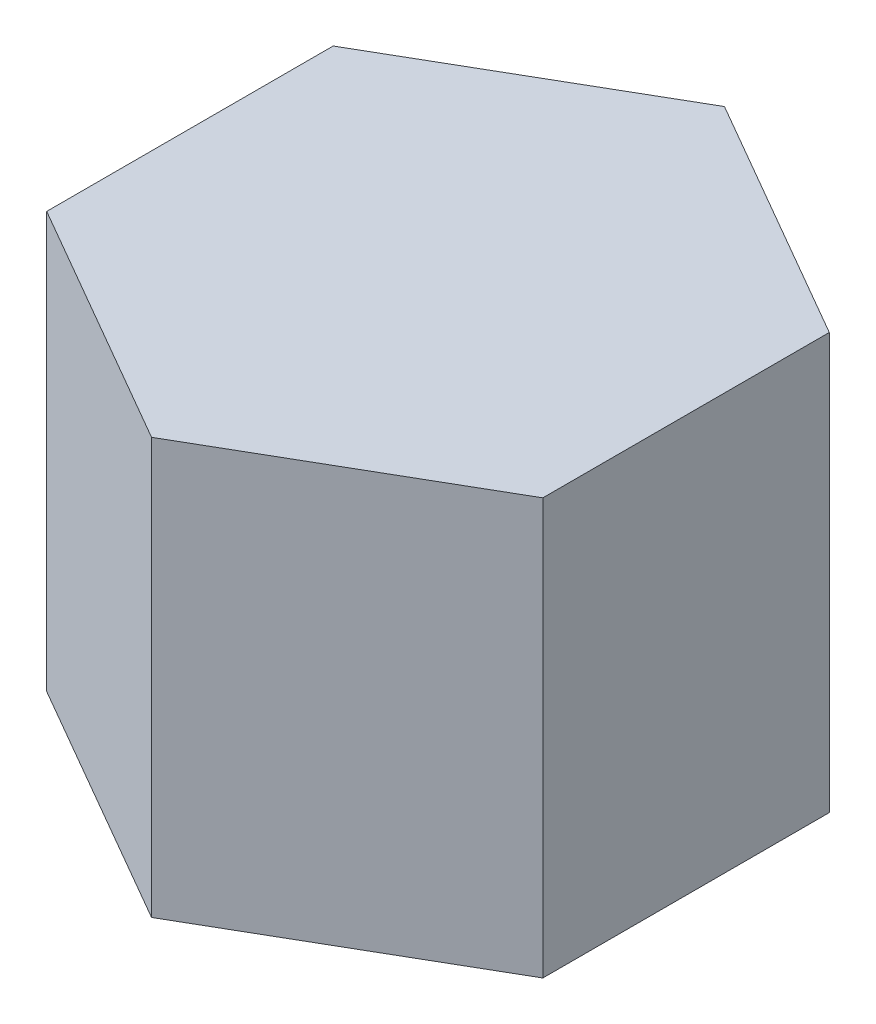
ISO-10303-21;
HEADER;
FILE_DESCRIPTION(('STEP AP214'),'2;1');
FILE_NAME('part.step','',(''),(''),'','','');
FILE_SCHEMA(('AUTOMOTIVE_DESIGN { 1 0 10303 214 1 1 1 1 }'));
ENDSEC;
DATA;
#1=APPLICATION_CONTEXT('core data for automotive mechanical design processes');
#2=APPLICATION_PROTOCOL_DEFINITION('international standard','automotive_design',2000,#1);
#3=PRODUCT_CONTEXT('',#1,'mechanical');
#4=PRODUCT('Part','Part','',(#3));
#5=PRODUCT_RELATED_PRODUCT_CATEGORY('part','',(#4));
#6=PRODUCT_DEFINITION_FORMATION('','',#4);
#7=PRODUCT_DEFINITION_CONTEXT('part definition',#1,'design');
#8=PRODUCT_DEFINITION('design','',#6,#7);
#9=PRODUCT_DEFINITION_SHAPE('','',#8);
#10=(LENGTH_UNIT() NAMED_UNIT(*) SI_UNIT(.MILLI.,.METRE.));
#11=(NAMED_UNIT(*) PLANE_ANGLE_UNIT() SI_UNIT($,.RADIAN.));
#12=(NAMED_UNIT(*) SI_UNIT($,.STERADIAN.) SOLID_ANGLE_UNIT());
#13=UNCERTAINTY_MEASURE_WITH_UNIT(LENGTH_MEASURE(1.E-05),#10,'distance_accuracy_value','');
#14=(GEOMETRIC_REPRESENTATION_CONTEXT(3) GLOBAL_UNCERTAINTY_ASSIGNED_CONTEXT((#13)) GLOBAL_UNIT_ASSIGNED_CONTEXT((#10,
#11,#12)) REPRESENTATION_CONTEXT('',''));
#15=CARTESIAN_POINT('',(0.,0.,0.));
#16=DIRECTION('',(0.,0.,1.));
#17=DIRECTION('',(1.,0.,0.));
#18=AXIS2_PLACEMENT_3D('',#15,#16,#17);
#19=CARTESIAN_POINT('',(209.642660308706,-148.537700895744,288.042869605357));
#20=DIRECTION('',(-0.499999999999943,0.,-0.866025403784472));
#21=DIRECTION('',(-0.866025403784472,0.,0.499999999999943));
#22=AXIS2_PLACEMENT_3D('',#19,#20,#21);
#23=PLANE('',#22);
#24=CARTESIAN_POINT('',(209.339551417382,-149.045793579175,288.217869605357));
#25=DIRECTION('',(0.866025403784471,0.,-0.499999999999943));
#26=VECTOR('',#25,1.);
#27=LINE('',#24,#26);
#28=CARTESIAN_POINT('',(209.339551417382,-149.045793579175,288.217869605357));
#29=VERTEX_POINT('',#28);
#30=CARTESIAN_POINT('',(209.642660308706,-149.045793579175,288.042869605357));
#31=VERTEX_POINT('',#30);
#32=EDGE_CURVE('E170',#29,#31,#27,.T.);
#33=ORIENTED_EDGE('',*,*,#32,.T.);
#34=CARTESIAN_POINT('',(209.642660308706,-148.537700895744,288.042869605357));
#35=DIRECTION('',(0.,-1.,0.));
#36=VECTOR('',#35,1.);
#37=LINE('',#34,#36);
#38=CARTESIAN_POINT('',(209.642660308706,-148.537700895744,288.042869605357));
#39=VERTEX_POINT('',#38);
#40=EDGE_CURVE('E35',#39,#31,#37,.T.);
#41=ORIENTED_EDGE('',*,*,#40,.F.);
#42=CARTESIAN_POINT('',(209.339551417382,-148.537700895744,288.217869605357));
#43=DIRECTION('',(0.866025403784471,0.,-0.499999999999943));
#44=VECTOR('',#43,1.);
#45=LINE('',#42,#44);
#46=CARTESIAN_POINT('',(209.339551417382,-148.537700895744,288.217869605357));
#47=VERTEX_POINT('',#46);
#48=EDGE_CURVE('E159',#47,#39,#45,.T.);
#49=ORIENTED_EDGE('',*,*,#48,.F.);
#50=CARTESIAN_POINT('',(209.339551417382,-148.537700895744,288.217869605357));
#51=DIRECTION('',(0.,-1.,0.));
#52=VECTOR('',#51,1.);
#53=LINE('',#50,#52);
#54=EDGE_CURVE('E10',#47,#29,#53,.T.);
#55=ORIENTED_EDGE('',*,*,#54,.T.);
#56=EDGE_LOOP('',(#33,#41,#49,#55));
#57=FACE_BOUND('',#56,.T.);
#58=ADVANCED_FACE('F16',(#57),#23,.F.);
#59=CARTESIAN_POINT('',(209.339551417382,-148.537700895744,288.217869605357));
#60=DIRECTION('',(0.500000000000062,0.,-0.866025403784403));
#61=DIRECTION('',(-0.866025403784403,0.,-0.500000000000062));
#62=AXIS2_PLACEMENT_3D('',#59,#60,#61);
#63=PLANE('',#62);
#64=CARTESIAN_POINT('',(209.036442526057,-149.045793579175,288.042869605357));
#65=DIRECTION('',(0.866025403784403,0.,0.500000000000062));
#66=VECTOR('',#65,1.);
#67=LINE('',#64,#66);
#68=CARTESIAN_POINT('',(209.036442526057,-149.045793579175,288.042869605357));
#69=VERTEX_POINT('',#68);
#70=EDGE_CURVE('E167',#69,#29,#67,.T.);
#71=ORIENTED_EDGE('',*,*,#70,.T.);
#72=ORIENTED_EDGE('',*,*,#54,.F.);
#73=CARTESIAN_POINT('',(209.036442526057,-148.537700895744,288.042869605357));
#74=DIRECTION('',(0.866025403784403,0.,0.500000000000062));
#75=VECTOR('',#74,1.);
#76=LINE('',#73,#75);
#77=CARTESIAN_POINT('',(209.036442526057,-148.537700895744,288.042869605357));
#78=VERTEX_POINT('',#77);
#79=EDGE_CURVE('E156',#78,#47,#76,.T.);
#80=ORIENTED_EDGE('',*,*,#79,.F.);
#81=CARTESIAN_POINT('',(209.036442526057,-148.537700895744,288.042869605357));
#82=DIRECTION('',(0.,-1.,0.));
#83=VECTOR('',#82,1.);
#84=LINE('',#81,#83);
#85=EDGE_CURVE('E27',#78,#69,#84,.T.);
#86=ORIENTED_EDGE('',*,*,#85,.T.);
#87=EDGE_LOOP('',(#71,#72,#80,#86));
#88=FACE_BOUND('',#87,.T.);
#89=ADVANCED_FACE('F189',(#88),#63,.F.);
#90=CARTESIAN_POINT('',(209.036442526057,-148.537700895744,290.831971220494));
#91=DIRECTION('',(1.,0.,0.));
#92=DIRECTION('',(0.,1.,0.));
#93=AXIS2_PLACEMENT_3D('',#90,#91,#92);
#94=PLANE('',#93);
#95=CARTESIAN_POINT('',(209.036442526057,-149.045793579175,287.692869605357));
#96=DIRECTION('',(0.,0.,1.));
#97=VECTOR('',#96,1.);
#98=LINE('',#95,#97);
#99=CARTESIAN_POINT('',(209.036442526057,-149.045793579175,287.692869605357));
#100=VERTEX_POINT('',#99);
#101=EDGE_CURVE('E163',#100,#69,#98,.T.);
#102=ORIENTED_EDGE('',*,*,#101,.T.);
#103=ORIENTED_EDGE('',*,*,#85,.F.);
#104=CARTESIAN_POINT('',(209.036442526057,-148.537700895744,287.692869605357));
#105=DIRECTION('',(0.,0.,1.));
#106=VECTOR('',#105,1.);
#107=LINE('',#104,#106);
#108=CARTESIAN_POINT('',(209.036442526057,-148.537700895744,287.692869605357));
#109=VERTEX_POINT('',#108);
#110=EDGE_CURVE('E106',#109,#78,#107,.T.);
#111=ORIENTED_EDGE('',*,*,#110,.F.);
#112=CARTESIAN_POINT('',(209.036442526057,-148.537700895744,287.692869605357));
#113=DIRECTION('',(0.,-1.,0.));
#114=VECTOR('',#113,1.);
#115=LINE('',#112,#114);
#116=EDGE_CURVE('E94',#109,#100,#115,.T.);
#117=ORIENTED_EDGE('',*,*,#116,.T.);
#118=EDGE_LOOP('',(#102,#103,#111,#117));
#119=FACE_BOUND('',#118,.T.);
#120=ADVANCED_FACE('F198',(#119),#94,.F.);
#121=CARTESIAN_POINT('',(209.036442526057,-148.537700895744,287.692869605357));
#122=DIRECTION('',(0.499999999999978,0.,0.866025403784452));
#123=DIRECTION('',(0.866025403784452,0.,-0.499999999999978));
#124=AXIS2_PLACEMENT_3D('',#121,#122,#123);
#125=PLANE('',#124);
#126=CARTESIAN_POINT('',(209.339551417382,-149.045793579175,287.517869605357));
#127=DIRECTION('',(-0.866025403784452,0.,0.499999999999978));
#128=VECTOR('',#127,1.);
#129=LINE('',#126,#128);
#130=CARTESIAN_POINT('',(209.339551417382,-149.045793579175,287.517869605357));
#131=VERTEX_POINT('',#130);
#132=EDGE_CURVE('E162',#131,#100,#129,.T.);
#133=ORIENTED_EDGE('',*,*,#132,.T.);
#134=ORIENTED_EDGE('',*,*,#116,.F.);
#135=CARTESIAN_POINT('',(209.339551417382,-148.537700895744,287.517869605357));
#136=DIRECTION('',(-0.866025403784452,0.,0.499999999999978));
#137=VECTOR('',#136,1.);
#138=LINE('',#135,#137);
#139=CARTESIAN_POINT('',(209.339551417382,-148.537700895744,287.517869605357));
#140=VERTEX_POINT('',#139);
#141=EDGE_CURVE('E98',#140,#109,#138,.T.);
#142=ORIENTED_EDGE('',*,*,#141,.F.);
#143=CARTESIAN_POINT('',(209.339551417382,-148.537700895744,287.517869605357));
#144=DIRECTION('',(0.,-1.,0.));
#145=VECTOR('',#144,1.);
#146=LINE('',#143,#145);
#147=EDGE_CURVE('E79',#140,#131,#146,.T.);
#148=ORIENTED_EDGE('',*,*,#147,.T.);
#149=EDGE_LOOP('',(#133,#134,#142,#148));
#150=FACE_BOUND('',#149,.T.);
#151=ADVANCED_FACE('F100',(#150),#125,.F.);
#152=CARTESIAN_POINT('',(209.339551417382,-148.537700895744,287.517869605357));
#153=DIRECTION('',(-0.499999999999943,0.,0.866025403784472));
#154=DIRECTION('',(0.866025403784472,0.,0.499999999999943));
#155=AXIS2_PLACEMENT_3D('',#152,#153,#154);
#156=PLANE('',#155);
#157=CARTESIAN_POINT('',(209.642660308706,-149.045793579175,287.692869605357));
#158=DIRECTION('',(-0.866025403784471,0.,-0.499999999999943));
#159=VECTOR('',#158,1.);
#160=LINE('',#157,#159);
#161=CARTESIAN_POINT('',(209.642660308706,-149.045793579175,287.692869605357));
#162=VERTEX_POINT('',#161);
#163=EDGE_CURVE('E88',#162,#131,#160,.T.);
#164=ORIENTED_EDGE('',*,*,#163,.T.);
#165=ORIENTED_EDGE('',*,*,#147,.F.);
#166=CARTESIAN_POINT('',(209.642660308706,-148.537700895744,287.692869605357));
#167=DIRECTION('',(-0.866025403784471,0.,-0.499999999999943));
#168=VECTOR('',#167,1.);
#169=LINE('',#166,#168);
#170=CARTESIAN_POINT('',(209.642660308706,-148.537700895744,287.692869605357));
#171=VERTEX_POINT('',#170);
#172=EDGE_CURVE('E84',#171,#140,#169,.T.);
#173=ORIENTED_EDGE('',*,*,#172,.F.);
#174=CARTESIAN_POINT('',(209.642660308706,-148.537700895744,287.692869605357));
#175=DIRECTION('',(0.,-1.,0.));
#176=VECTOR('',#175,1.);
#177=LINE('',#174,#176);
#178=EDGE_CURVE('E58',#171,#162,#177,.T.);
#179=ORIENTED_EDGE('',*,*,#178,.T.);
#180=EDGE_LOOP('',(#164,#165,#173,#179));
#181=FACE_BOUND('',#180,.T.);
#182=ADVANCED_FACE('F82',(#181),#156,.F.);
#183=CARTESIAN_POINT('',(209.642660308706,-148.537700895744,290.831971220494));
#184=DIRECTION('',(-1.,0.,0.));
#185=DIRECTION('',(0.,-1.,0.));
#186=AXIS2_PLACEMENT_3D('',#183,#184,#185);
#187=PLANE('',#186);
#188=CARTESIAN_POINT('',(209.642660308706,-149.045793579175,288.042869605357));
#189=DIRECTION('',(0.,0.,-1.));
#190=VECTOR('',#189,1.);
#191=LINE('',#188,#190);
#192=EDGE_CURVE('E160',#31,#162,#191,.T.);
#193=ORIENTED_EDGE('',*,*,#192,.T.);
#194=ORIENTED_EDGE('',*,*,#178,.F.);
#195=CARTESIAN_POINT('',(209.642660308706,-148.537700895744,288.042869605357));
#196=DIRECTION('',(0.,0.,-1.));
#197=VECTOR('',#196,1.);
#198=LINE('',#195,#197);
#199=EDGE_CURVE('E112',#39,#171,#198,.T.);
#200=ORIENTED_EDGE('',*,*,#199,.F.);
#201=ORIENTED_EDGE('',*,*,#40,.T.);
#202=EDGE_LOOP('',(#193,#194,#200,#201));
#203=FACE_BOUND('',#202,.T.);
#204=ADVANCED_FACE('F131',(#203),#187,.F.);
#205=CARTESIAN_POINT('',(206.339551417382,-148.537700895744,290.831971220494));
#206=DIRECTION('',(0.,-1.,0.));
#207=DIRECTION('',(1.,0.,0.));
#208=AXIS2_PLACEMENT_3D('',#205,#206,#207);
#209=PLANE('',#208);
#210=ORIENTED_EDGE('',*,*,#48,.T.);
#211=ORIENTED_EDGE('',*,*,#199,.T.);
#212=ORIENTED_EDGE('',*,*,#172,.T.);
#213=ORIENTED_EDGE('',*,*,#141,.T.);
#214=ORIENTED_EDGE('',*,*,#110,.T.);
#215=ORIENTED_EDGE('',*,*,#79,.T.);
#216=EDGE_LOOP('',(#210,#211,#212,#213,#214,#215));
#217=FACE_BOUND('',#216,.T.);
#218=ADVANCED_FACE('F111',(#217),#209,.F.);
#219=CARTESIAN_POINT('',(206.339551417382,-149.045793579175,290.831971220494));
#220=DIRECTION('',(0.,-1.,0.));
#221=DIRECTION('',(1.,0.,0.));
#222=AXIS2_PLACEMENT_3D('',#219,#220,#221);
#223=PLANE('',#222);
#224=ORIENTED_EDGE('',*,*,#32,.F.);
#225=ORIENTED_EDGE('',*,*,#70,.F.);
#226=ORIENTED_EDGE('',*,*,#101,.F.);
#227=ORIENTED_EDGE('',*,*,#132,.F.);
#228=ORIENTED_EDGE('',*,*,#163,.F.);
#229=ORIENTED_EDGE('',*,*,#192,.F.);
#230=EDGE_LOOP('',(#224,#225,#226,#227,#228,#229));
#231=FACE_BOUND('',#230,.T.);
#232=ADVANCED_FACE('F130',(#231),#223,.T.);
#233=CLOSED_SHELL('',(#58,#89,#120,#151,#182,#204,#218,#232));
#234=MANIFOLD_SOLID_BREP('B1',#233);
#235=ADVANCED_BREP_SHAPE_REPRESENTATION('',(#18,#234),#14);
#236=SHAPE_DEFINITION_REPRESENTATION(#9,#235);
ENDSEC;
END-ISO-10303-21;
